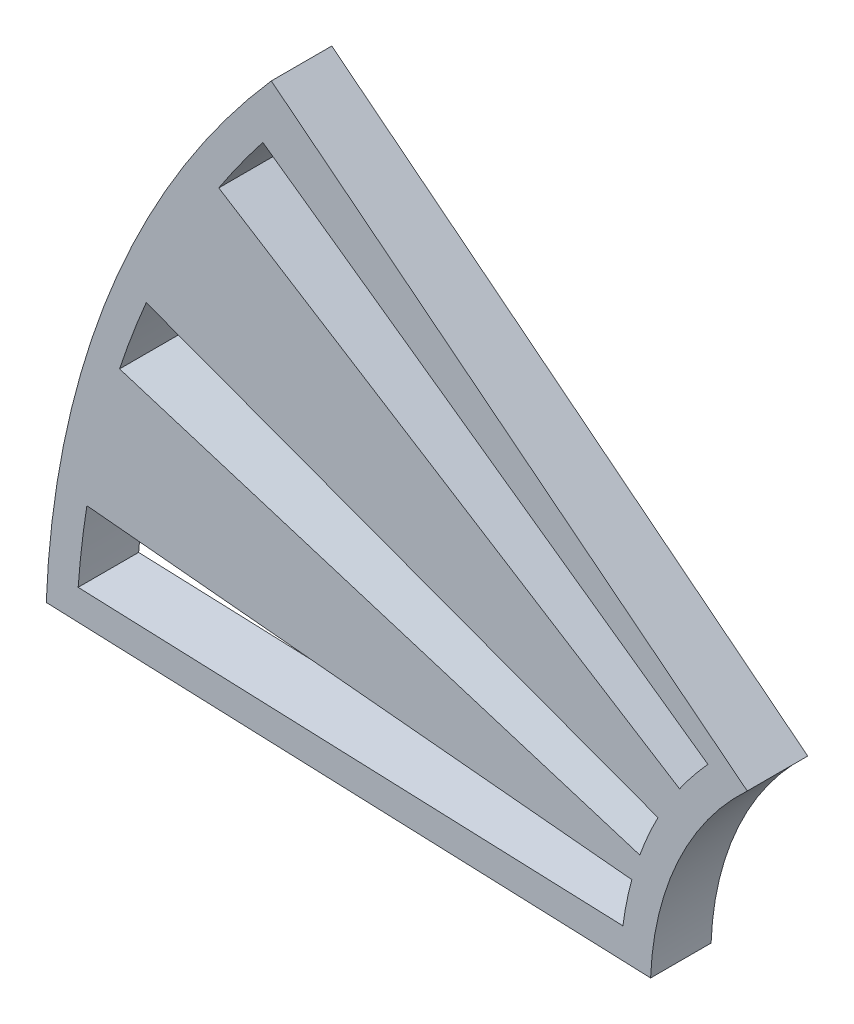
ISO-10303-21;
HEADER;
FILE_DESCRIPTION(('STEP AP214'),'2;1');
FILE_NAME('part.step','',(''),(''),'','','');
FILE_SCHEMA(('AUTOMOTIVE_DESIGN { 1 0 10303 214 1 1 1 1 }'));
ENDSEC;
DATA;
#1=APPLICATION_CONTEXT('core data for automotive mechanical design processes');
#2=APPLICATION_PROTOCOL_DEFINITION('international standard','automotive_design',2000,#1);
#3=PRODUCT_CONTEXT('',#1,'mechanical');
#4=PRODUCT('Part','Part','',(#3));
#5=PRODUCT_RELATED_PRODUCT_CATEGORY('part','',(#4));
#6=PRODUCT_DEFINITION_FORMATION('','',#4);
#7=PRODUCT_DEFINITION_CONTEXT('part definition',#1,'design');
#8=PRODUCT_DEFINITION('design','',#6,#7);
#9=PRODUCT_DEFINITION_SHAPE('','',#8);
#10=(LENGTH_UNIT() NAMED_UNIT(*) SI_UNIT(.MILLI.,.METRE.));
#11=(NAMED_UNIT(*) PLANE_ANGLE_UNIT() SI_UNIT($,.RADIAN.));
#12=(NAMED_UNIT(*) SI_UNIT($,.STERADIAN.) SOLID_ANGLE_UNIT());
#13=UNCERTAINTY_MEASURE_WITH_UNIT(LENGTH_MEASURE(1.E-05),#10,'distance_accuracy_value','');
#14=(GEOMETRIC_REPRESENTATION_CONTEXT(3) GLOBAL_UNCERTAINTY_ASSIGNED_CONTEXT((#13)) GLOBAL_UNIT_ASSIGNED_CONTEXT((#10,
#11,#12)) REPRESENTATION_CONTEXT('',''));
#15=CARTESIAN_POINT('',(0.,0.,0.));
#16=DIRECTION('',(0.,0.,1.));
#17=DIRECTION('',(1.,0.,0.));
#18=AXIS2_PLACEMENT_3D('',#15,#16,#17);
#19=CARTESIAN_POINT('',(0.,0.,4.));
#20=DIRECTION('',(0.,0.,1.));
#21=DIRECTION('',(1.,0.,0.));
#22=AXIS2_PLACEMENT_3D('',#19,#20,#21);
#23=PLANE('',#22);
#24=CARTESIAN_POINT('',(0.,0.,4.));
#25=DIRECTION('',(0.,0.,1.));
#26=DIRECTION('',(1.,0.,0.));
#27=AXIS2_PLACEMENT_3D('',#24,#25,#26);
#28=CIRCLE('',#27,22.);
#29=CARTESIAN_POINT('',(-16.3569194216375,14.7122801439497,4.));
#30=VERTEX_POINT('',#29);
#31=CARTESIAN_POINT('',(-18.0672432142084,12.5528770661805,4.));
#32=VERTEX_POINT('',#31);
#33=EDGE_CURVE('E367',#30,#32,#28,.T.);
#34=ORIENTED_EDGE('',*,*,#33,.T.);
#35=DIRECTION('',(-0.846325198964337,0.532666553857078,0.));
#36=VECTOR('',#35,1.);
#37=CARTESIAN_POINT('',(0.532666553857077,0.846325198964337,4.));
#38=LINE('',#37,#36);
#39=CARTESIAN_POINT('',(-48.5468985369015,31.7363930283167,4.));
#40=VERTEX_POINT('',#39);
#41=EDGE_CURVE('E382',#32,#40,#38,.T.);
#42=ORIENTED_EDGE('',*,*,#41,.T.);
#43=CARTESIAN_POINT('',(0.,0.,4.));
#44=DIRECTION('',(0.,0.,1.));
#45=DIRECTION('',(1.,0.,0.));
#46=AXIS2_PLACEMENT_3D('',#43,#44,#45);
#47=CIRCLE('',#46,58.);
#48=CARTESIAN_POINT('',(-45.6331540183943,35.7996543884644,4.));
#49=VERTEX_POINT('',#48);
#50=EDGE_CURVE('E358',#49,#40,#47,.T.);
#51=ORIENTED_EDGE('',*,*,#50,.F.);
#52=DIRECTION('',(-0.81535782054526,0.578957359807856,0.));
#53=VECTOR('',#52,1.);
#54=CARTESIAN_POINT('',(1.60364114285886,2.25844153291714,4.));
#55=LINE('',#54,#53);
#56=CARTESIAN_POINT('',(-16.191490090042,14.8941481348908,4.));
#57=VERTEX_POINT('',#56);
#58=EDGE_CURVE('E385',#57,#49,#55,.T.);
#59=ORIENTED_EDGE('',*,*,#58,.F.);
#60=DIRECTION('',(0.672883873931036,0.739748127543126,0.));
#61=VECTOR('',#60,1.);
#62=CARTESIAN_POINT('',(-16.2742047558396,14.8032141394205,4.));
#63=LINE('',#62,#61);
#64=EDGE_CURVE('E387',#30,#57,#63,.T.);
#65=ORIENTED_EDGE('',*,*,#64,.F.);
#66=EDGE_LOOP('',(#34,#42,#51,#59,#65));
#67=FACE_BOUND('',#66,.T.);
#68=CARTESIAN_POINT('',(0.,0.,4.));
#69=DIRECTION('',(0.,0.,1.));
#70=DIRECTION('',(1.,0.,0.));
#71=AXIS2_PLACEMENT_3D('',#68,#69,#70);
#72=CIRCLE('',#71,58.);
#73=CARTESIAN_POINT('',(-53.3438743652165,22.7690813979834,4.));
#74=VERTEX_POINT('',#73);
#75=CARTESIAN_POINT('',(-55.1066860216154,18.0901397373016,4.));
#76=VERTEX_POINT('',#75);
#77=EDGE_CURVE('E429',#74,#76,#72,.T.);
#78=ORIENTED_EDGE('',*,*,#77,.F.);
#79=DIRECTION('',(-0.93742036755198,0.348199733628144,0.));
#80=VECTOR('',#79,1.);
#81=CARTESIAN_POINT('',(0.964470715017603,2.59653987309038,4.));
#82=LINE('',#81,#80);
#83=CARTESIAN_POINT('',(-19.494667641963,10.1959763401746,4.));
#84=VERTEX_POINT('',#83);
#85=EDGE_CURVE('E426',#84,#74,#82,.T.);
#86=ORIENTED_EDGE('',*,*,#85,.F.);
#87=CARTESIAN_POINT('',(0.,0.,4.));
#88=DIRECTION('',(0.,0.,1.));
#89=DIRECTION('',(1.,0.,0.));
#90=AXIS2_PLACEMENT_3D('',#87,#88,#89);
#91=CIRCLE('',#90,22.);
#92=CARTESIAN_POINT('',(-20.700540486008,7.44900151611905,4.));
#93=VERTEX_POINT('',#92);
#94=EDGE_CURVE('E423',#84,#93,#91,.T.);
#95=ORIENTED_EDGE('',*,*,#94,.T.);
#96=DIRECTION('',(-0.955351615946227,0.295471301328797,0.));
#97=VECTOR('',#96,1.);
#98=CARTESIAN_POINT('',(0.295471301328797,0.955351615946228,4.));
#99=LINE('',#98,#97);
#100=EDGE_CURVE('E431',#93,#76,#99,.T.);
#101=ORIENTED_EDGE('',*,*,#100,.T.);
#102=EDGE_LOOP('',(#78,#86,#95,#101));
#103=FACE_BOUND('',#102,.T.);
#104=CARTESIAN_POINT('',(0.,0.,4.));
#105=DIRECTION('',(0.,0.,1.));
#106=DIRECTION('',(1.,0.,0.));
#107=AXIS2_PLACEMENT_3D('',#104,#105,#106);
#108=CIRCLE('',#107,20.);
#109=CARTESIAN_POINT('',(-13.592462365831,14.671229220262,4.));
#110=VERTEX_POINT('',#109);
#111=CARTESIAN_POINT('',(-19.9854479818915,0.762803358087425,4.));
#112=VERTEX_POINT('',#111);
#113=EDGE_CURVE('E454',#110,#112,#108,.T.);
#114=ORIENTED_EDGE('',*,*,#113,.F.);
#115=DIRECTION('',(-0.783940113940182,0.620836450086055,0.));
#116=VECTOR('',#115,1.);
#117=CARTESIAN_POINT('',(-13.592462365831,14.671229220262,4.));
#118=LINE('',#117,#116);
#119=CARTESIAN_POINT('',(-45.0736727010104,39.6025760430074,4.));
#120=VERTEX_POINT('',#119);
#121=EDGE_CURVE('E463',#110,#120,#118,.T.);
#122=ORIENTED_EDGE('',*,*,#121,.T.);
#123=CARTESIAN_POINT('',(0.,0.,4.));
#124=DIRECTION('',(0.,0.,1.));
#125=DIRECTION('',(1.,0.,0.));
#126=AXIS2_PLACEMENT_3D('',#123,#124,#125);
#127=CIRCLE('',#126,60.);
#128=CARTESIAN_POINT('',(-59.9563439456744,2.28841007426227,4.));
#129=VERTEX_POINT('',#128);
#130=EDGE_CURVE('E461',#120,#129,#127,.T.);
#131=ORIENTED_EDGE('',*,*,#130,.T.);
#132=DIRECTION('',(-0.999272399094574,0.0381401679043713,0.));
#133=VECTOR('',#132,1.);
#134=CARTESIAN_POINT('',(-19.9854479818915,0.762803358087425,4.));
#135=LINE('',#134,#133);
#136=EDGE_CURVE('E457',#112,#129,#135,.T.);
#137=ORIENTED_EDGE('',*,*,#136,.F.);
#138=EDGE_LOOP('',(#114,#122,#131,#137));
#139=FACE_BOUND('',#138,.T.);
#140=CARTESIAN_POINT('',(0.,0.,4.));
#141=DIRECTION('',(0.,0.,1.));
#142=DIRECTION('',(1.,0.,0.));
#143=AXIS2_PLACEMENT_3D('',#140,#141,#142);
#144=CIRCLE('',#143,58.);
#145=CARTESIAN_POINT('',(-57.2695634611574,9.17589782901159,4.));
#146=VERTEX_POINT('',#145);
#147=CARTESIAN_POINT('',(-57.8470508935835,4.20935896724981,4.));
#148=VERTEX_POINT('',#147);
#149=EDGE_CURVE('E420',#146,#148,#144,.T.);
#150=ORIENTED_EDGE('',*,*,#149,.F.);
#151=DIRECTION('',(-0.995579779225786,0.0939196635254627,0.));
#152=VECTOR('',#151,1.);
#153=CARTESIAN_POINT('',(0.352818627186008,3.7399952020203,4.));
#154=LINE('',#153,#152);
#155=CARTESIAN_POINT('',(-21.228263800293,5.77588227244706,4.));
#156=VERTEX_POINT('',#155);
#157=EDGE_CURVE('E405',#156,#146,#154,.T.);
#158=ORIENTED_EDGE('',*,*,#157,.F.);
#159=CARTESIAN_POINT('',(0.,0.,4.));
#160=DIRECTION('',(0.,0.,1.));
#161=DIRECTION('',(1.,0.,0.));
#162=AXIS2_PLACEMENT_3D('',#159,#160,#161);
#163=CIRCLE('',#162,22.);
#164=CARTESIAN_POINT('',(-21.8166810272474,2.8341540105195,4.));
#165=VERTEX_POINT('',#164);
#166=EDGE_CURVE('E400',#156,#165,#163,.T.);
#167=ORIENTED_EDGE('',*,*,#166,.T.);
#168=DIRECTION('',(-0.999272399094574,0.0381401679043713,0.));
#169=VECTOR('',#168,1.);
#170=CARTESIAN_POINT('',(0.0762803358087425,1.99854479818915,4.));
#171=LINE('',#170,#169);
#172=EDGE_CURVE('E417',#165,#148,#171,.T.);
#173=ORIENTED_EDGE('',*,*,#172,.T.);
#174=EDGE_LOOP('',(#150,#158,#167,#173));
#175=FACE_BOUND('',#174,.T.);
#176=ADVANCED_FACE('F232',(#67,#103,#139,#175),#23,.T.);
#177=CARTESIAN_POINT('',(0.,0.,0.));
#178=DIRECTION('',(0.,0.,1.));
#179=DIRECTION('',(1.,0.,0.));
#180=AXIS2_PLACEMENT_3D('',#177,#178,#179);
#181=PLANE('',#180);
#182=DIRECTION('',(-0.846325198964337,0.532666553857078,0.));
#183=VECTOR('',#182,1.);
#184=CARTESIAN_POINT('',(0.532666553857077,0.846325198964337,0.));
#185=LINE('',#184,#183);
#186=CARTESIAN_POINT('',(-18.0672432142084,12.5528770661805,0.));
#187=VERTEX_POINT('',#186);
#188=CARTESIAN_POINT('',(-48.5468985369015,31.7363930283167,0.));
#189=VERTEX_POINT('',#188);
#190=EDGE_CURVE('E364',#187,#189,#185,.T.);
#191=ORIENTED_EDGE('',*,*,#190,.F.);
#192=CARTESIAN_POINT('',(0.,0.,0.));
#193=DIRECTION('',(0.,0.,1.));
#194=DIRECTION('',(1.,0.,0.));
#195=AXIS2_PLACEMENT_3D('',#192,#193,#194);
#196=CIRCLE('',#195,22.);
#197=CARTESIAN_POINT('',(-16.3569194216375,14.7122801439497,0.));
#198=VERTEX_POINT('',#197);
#199=EDGE_CURVE('E257',#198,#187,#196,.T.);
#200=ORIENTED_EDGE('',*,*,#199,.F.);
#201=DIRECTION('',(0.672883873931036,0.739748127543126,0.));
#202=VECTOR('',#201,1.);
#203=CARTESIAN_POINT('',(-16.2742047558396,14.8032141394205,0.));
#204=LINE('',#203,#202);
#205=CARTESIAN_POINT('',(-16.191490090042,14.8941481348908,0.));
#206=VERTEX_POINT('',#205);
#207=EDGE_CURVE('E375',#198,#206,#204,.T.);
#208=ORIENTED_EDGE('',*,*,#207,.T.);
#209=DIRECTION('',(-0.81535782054526,0.578957359807856,0.));
#210=VECTOR('',#209,1.);
#211=CARTESIAN_POINT('',(1.60364114285886,2.25844153291714,0.));
#212=LINE('',#211,#210);
#213=CARTESIAN_POINT('',(-45.6331540183943,35.7996543884644,0.));
#214=VERTEX_POINT('',#213);
#215=EDGE_CURVE('E373',#206,#214,#212,.T.);
#216=ORIENTED_EDGE('',*,*,#215,.T.);
#217=CARTESIAN_POINT('',(0.,0.,0.));
#218=DIRECTION('',(0.,0.,1.));
#219=DIRECTION('',(1.,0.,0.));
#220=AXIS2_PLACEMENT_3D('',#217,#218,#219);
#221=CIRCLE('',#220,58.);
#222=EDGE_CURVE('E355',#214,#189,#221,.T.);
#223=ORIENTED_EDGE('',*,*,#222,.T.);
#224=EDGE_LOOP('',(#191,#200,#208,#216,#223));
#225=FACE_BOUND('',#224,.T.);
#226=DIRECTION('',(-0.93742036755198,0.348199733628144,0.));
#227=VECTOR('',#226,1.);
#228=CARTESIAN_POINT('',(0.964470715017603,2.59653987309038,0.));
#229=LINE('',#228,#227);
#230=CARTESIAN_POINT('',(-19.494667641963,10.1959763401746,0.));
#231=VERTEX_POINT('',#230);
#232=CARTESIAN_POINT('',(-53.3438743652165,22.7690813979834,0.));
#233=VERTEX_POINT('',#232);
#234=EDGE_CURVE('E437',#231,#233,#229,.T.);
#235=ORIENTED_EDGE('',*,*,#234,.T.);
#236=CARTESIAN_POINT('',(0.,0.,0.));
#237=DIRECTION('',(0.,0.,1.));
#238=DIRECTION('',(1.,0.,0.));
#239=AXIS2_PLACEMENT_3D('',#236,#237,#238);
#240=CIRCLE('',#239,58.);
#241=CARTESIAN_POINT('',(-55.1066860216154,18.0901397373016,0.));
#242=VERTEX_POINT('',#241);
#243=EDGE_CURVE('E440',#233,#242,#240,.T.);
#244=ORIENTED_EDGE('',*,*,#243,.T.);
#245=DIRECTION('',(-0.955351615946227,0.295471301328797,0.));
#246=VECTOR('',#245,1.);
#247=CARTESIAN_POINT('',(0.295471301328797,0.955351615946228,0.));
#248=LINE('',#247,#246);
#249=CARTESIAN_POINT('',(-20.700540486008,7.44900151611905,0.));
#250=VERTEX_POINT('',#249);
#251=EDGE_CURVE('E427',#250,#242,#248,.T.);
#252=ORIENTED_EDGE('',*,*,#251,.F.);
#253=CARTESIAN_POINT('',(0.,0.,0.));
#254=DIRECTION('',(0.,0.,1.));
#255=DIRECTION('',(1.,0.,0.));
#256=AXIS2_PLACEMENT_3D('',#253,#254,#255);
#257=CIRCLE('',#256,22.);
#258=EDGE_CURVE('E414',#231,#250,#257,.T.);
#259=ORIENTED_EDGE('',*,*,#258,.F.);
#260=EDGE_LOOP('',(#235,#244,#252,#259));
#261=FACE_BOUND('',#260,.T.);
#262=CARTESIAN_POINT('',(0.,0.,0.));
#263=DIRECTION('',(0.,0.,1.));
#264=DIRECTION('',(1.,0.,0.));
#265=AXIS2_PLACEMENT_3D('',#262,#263,#264);
#266=CIRCLE('',#265,20.);
#267=CARTESIAN_POINT('',(-13.592462365831,14.671229220262,0.));
#268=VERTEX_POINT('',#267);
#269=CARTESIAN_POINT('',(-19.9854479818915,0.762803358087425,0.));
#270=VERTEX_POINT('',#269);
#271=EDGE_CURVE('E453',#268,#270,#266,.T.);
#272=ORIENTED_EDGE('',*,*,#271,.T.);
#273=DIRECTION('',(-0.999272399094574,0.0381401679043713,0.));
#274=VECTOR('',#273,1.);
#275=CARTESIAN_POINT('',(-19.9854479818915,0.762803358087425,0.));
#276=LINE('',#275,#274);
#277=CARTESIAN_POINT('',(-59.9563439456744,2.28841007426227,0.));
#278=VERTEX_POINT('',#277);
#279=EDGE_CURVE('E467',#270,#278,#276,.T.);
#280=ORIENTED_EDGE('',*,*,#279,.T.);
#281=CARTESIAN_POINT('',(0.,0.,0.));
#282=DIRECTION('',(0.,0.,1.));
#283=DIRECTION('',(1.,0.,0.));
#284=AXIS2_PLACEMENT_3D('',#281,#282,#283);
#285=CIRCLE('',#284,60.);
#286=CARTESIAN_POINT('',(-45.0736727010104,39.6025760430074,0.));
#287=VERTEX_POINT('',#286);
#288=EDGE_CURVE('E470',#287,#278,#285,.T.);
#289=ORIENTED_EDGE('',*,*,#288,.F.);
#290=DIRECTION('',(-0.783940113940182,0.620836450086055,0.));
#291=VECTOR('',#290,1.);
#292=CARTESIAN_POINT('',(-13.592462365831,14.671229220262,0.));
#293=LINE('',#292,#291);
#294=EDGE_CURVE('E458',#268,#287,#293,.T.);
#295=ORIENTED_EDGE('',*,*,#294,.F.);
#296=EDGE_LOOP('',(#272,#280,#289,#295));
#297=FACE_BOUND('',#296,.T.);
#298=DIRECTION('',(-0.995579779225786,0.0939196635254627,0.));
#299=VECTOR('',#298,1.);
#300=CARTESIAN_POINT('',(0.352818627186008,3.7399952020203,0.));
#301=LINE('',#300,#299);
#302=CARTESIAN_POINT('',(-21.228263800293,5.77588227244706,0.));
#303=VERTEX_POINT('',#302);
#304=CARTESIAN_POINT('',(-57.2695634611574,9.17589782901159,0.));
#305=VERTEX_POINT('',#304);
#306=EDGE_CURVE('E411',#303,#305,#301,.T.);
#307=ORIENTED_EDGE('',*,*,#306,.T.);
#308=CARTESIAN_POINT('',(0.,0.,0.));
#309=DIRECTION('',(0.,0.,1.));
#310=DIRECTION('',(1.,0.,0.));
#311=AXIS2_PLACEMENT_3D('',#308,#309,#310);
#312=CIRCLE('',#311,58.);
#313=CARTESIAN_POINT('',(-57.8470508935835,4.20935896724981,0.));
#314=VERTEX_POINT('',#313);
#315=EDGE_CURVE('E408',#305,#314,#312,.T.);
#316=ORIENTED_EDGE('',*,*,#315,.T.);
#317=DIRECTION('',(-0.999272399094574,0.0381401679043713,0.));
#318=VECTOR('',#317,1.);
#319=CARTESIAN_POINT('',(0.0762803358087425,1.99854479818915,0.));
#320=LINE('',#319,#318);
#321=CARTESIAN_POINT('',(-21.8166810272474,2.8341540105195,0.));
#322=VERTEX_POINT('',#321);
#323=EDGE_CURVE('E404',#322,#314,#320,.T.);
#324=ORIENTED_EDGE('',*,*,#323,.F.);
#325=CARTESIAN_POINT('',(0.,0.,0.));
#326=DIRECTION('',(0.,0.,1.));
#327=DIRECTION('',(1.,0.,0.));
#328=AXIS2_PLACEMENT_3D('',#325,#326,#327);
#329=CIRCLE('',#328,22.);
#330=EDGE_CURVE('E401',#303,#322,#329,.T.);
#331=ORIENTED_EDGE('',*,*,#330,.F.);
#332=EDGE_LOOP('',(#307,#316,#324,#331));
#333=FACE_BOUND('',#332,.T.);
#334=ADVANCED_FACE('F369',(#225,#261,#297,#333),#181,.F.);
#335=CARTESIAN_POINT('',(0.,0.,4.));
#336=DIRECTION('',(0.,0.,-1.));
#337=DIRECTION('',(-1.,0.,0.));
#338=AXIS2_PLACEMENT_3D('',#335,#336,#337);
#339=CYLINDRICAL_SURFACE('',#338,20.);
#340=ORIENTED_EDGE('',*,*,#271,.F.);
#341=DIRECTION('',(0.,0.,-1.));
#342=VECTOR('',#341,1.);
#343=CARTESIAN_POINT('',(-13.592462365831,14.671229220262,4.));
#344=LINE('',#343,#342);
#345=EDGE_CURVE('E12',#110,#268,#344,.T.);
#346=ORIENTED_EDGE('',*,*,#345,.F.);
#347=ORIENTED_EDGE('',*,*,#113,.T.);
#348=DIRECTION('',(0.,0.,-1.));
#349=VECTOR('',#348,1.);
#350=CARTESIAN_POINT('',(-19.9854479818915,0.762803358087425,4.));
#351=LINE('',#350,#349);
#352=EDGE_CURVE('E236',#112,#270,#351,.T.);
#353=ORIENTED_EDGE('',*,*,#352,.T.);
#354=EDGE_LOOP('',(#340,#346,#347,#353));
#355=FACE_BOUND('',#354,.T.);
#356=ADVANCED_FACE('F234',(#355),#339,.F.);
#357=CARTESIAN_POINT('',(-13.592462365831,14.671229220262,4.));
#358=DIRECTION('',(-0.620836450086055,-0.783940113940182,0.));
#359=DIRECTION('',(0.783940113940182,-0.620836450086055,0.));
#360=AXIS2_PLACEMENT_3D('',#357,#358,#359);
#361=PLANE('',#360);
#362=ORIENTED_EDGE('',*,*,#294,.T.);
#363=DIRECTION('',(0.,0.,-1.));
#364=VECTOR('',#363,1.);
#365=CARTESIAN_POINT('',(-45.0736727010104,39.6025760430074,4.));
#366=LINE('',#365,#364);
#367=EDGE_CURVE('E241',#120,#287,#366,.T.);
#368=ORIENTED_EDGE('',*,*,#367,.F.);
#369=ORIENTED_EDGE('',*,*,#121,.F.);
#370=ORIENTED_EDGE('',*,*,#345,.T.);
#371=EDGE_LOOP('',(#362,#368,#369,#370));
#372=FACE_BOUND('',#371,.T.);
#373=ADVANCED_FACE('F490',(#372),#361,.F.);
#374=CARTESIAN_POINT('',(0.,0.,4.));
#375=DIRECTION('',(0.,0.,-1.));
#376=DIRECTION('',(-1.,0.,0.));
#377=AXIS2_PLACEMENT_3D('',#374,#375,#376);
#378=CYLINDRICAL_SURFACE('',#377,60.);
#379=ORIENTED_EDGE('',*,*,#288,.T.);
#380=DIRECTION('',(0.,0.,-1.));
#381=VECTOR('',#380,1.);
#382=CARTESIAN_POINT('',(-59.9563439456744,2.28841007426227,4.));
#383=LINE('',#382,#381);
#384=EDGE_CURVE('E475',#129,#278,#383,.T.);
#385=ORIENTED_EDGE('',*,*,#384,.F.);
#386=ORIENTED_EDGE('',*,*,#130,.F.);
#387=ORIENTED_EDGE('',*,*,#367,.T.);
#388=EDGE_LOOP('',(#379,#385,#386,#387));
#389=FACE_BOUND('',#388,.T.);
#390=ADVANCED_FACE('F494',(#389),#378,.T.);
#391=CARTESIAN_POINT('',(-19.9854479818915,0.762803358087425,4.));
#392=DIRECTION('',(-0.0381401679043713,-0.999272399094575,0.));
#393=DIRECTION('',(0.999272399094575,-0.0381401679043713,0.));
#394=AXIS2_PLACEMENT_3D('',#391,#392,#393);
#395=PLANE('',#394);
#396=ORIENTED_EDGE('',*,*,#279,.F.);
#397=ORIENTED_EDGE('',*,*,#352,.F.);
#398=ORIENTED_EDGE('',*,*,#136,.T.);
#399=ORIENTED_EDGE('',*,*,#384,.T.);
#400=EDGE_LOOP('',(#396,#397,#398,#399));
#401=FACE_BOUND('',#400,.T.);
#402=ADVANCED_FACE('F483',(#401),#395,.T.);
#403=CARTESIAN_POINT('',(0.964470715017603,2.59653987309038,4.));
#404=DIRECTION('',(-0.348199733628144,-0.93742036755198,0.));
#405=DIRECTION('',(0.93742036755198,-0.348199733628144,0.));
#406=AXIS2_PLACEMENT_3D('',#403,#404,#405);
#407=PLANE('',#406);
#408=ORIENTED_EDGE('',*,*,#234,.F.);
#409=DIRECTION('',(0.,0.,-1.));
#410=VECTOR('',#409,1.);
#411=CARTESIAN_POINT('',(-19.494667641963,10.1959763401746,4.));
#412=LINE('',#411,#410);
#413=EDGE_CURVE('E450',#84,#231,#412,.T.);
#414=ORIENTED_EDGE('',*,*,#413,.F.);
#415=ORIENTED_EDGE('',*,*,#85,.T.);
#416=DIRECTION('',(0.,0.,-1.));
#417=VECTOR('',#416,1.);
#418=CARTESIAN_POINT('',(-53.3438743652165,22.7690813979834,4.));
#419=LINE('',#418,#417);
#420=EDGE_CURVE('E448',#74,#233,#419,.T.);
#421=ORIENTED_EDGE('',*,*,#420,.T.);
#422=EDGE_LOOP('',(#408,#414,#415,#421));
#423=FACE_BOUND('',#422,.T.);
#424=ADVANCED_FACE('F536',(#423),#407,.T.);
#425=CARTESIAN_POINT('',(0.,0.,4.));
#426=DIRECTION('',(0.,0.,-1.));
#427=DIRECTION('',(-1.,0.,0.));
#428=AXIS2_PLACEMENT_3D('',#425,#426,#427);
#429=CYLINDRICAL_SURFACE('',#428,58.);
#430=ORIENTED_EDGE('',*,*,#243,.F.);
#431=ORIENTED_EDGE('',*,*,#420,.F.);
#432=ORIENTED_EDGE('',*,*,#77,.T.);
#433=DIRECTION('',(0.,0.,-1.));
#434=VECTOR('',#433,1.);
#435=CARTESIAN_POINT('',(-55.1066860216154,18.0901397373016,4.));
#436=LINE('',#435,#434);
#437=EDGE_CURVE('E446',#76,#242,#436,.T.);
#438=ORIENTED_EDGE('',*,*,#437,.T.);
#439=EDGE_LOOP('',(#430,#431,#432,#438));
#440=FACE_BOUND('',#439,.T.);
#441=ADVANCED_FACE('F532',(#440),#429,.F.);
#442=CARTESIAN_POINT('',(0.295471301328797,0.955351615946228,4.));
#443=DIRECTION('',(-0.295471301328797,-0.955351615946227,0.));
#444=DIRECTION('',(0.955351615946227,-0.295471301328797,0.));
#445=AXIS2_PLACEMENT_3D('',#442,#443,#444);
#446=PLANE('',#445);
#447=ORIENTED_EDGE('',*,*,#251,.T.);
#448=ORIENTED_EDGE('',*,*,#437,.F.);
#449=ORIENTED_EDGE('',*,*,#100,.F.);
#450=DIRECTION('',(0.,0.,-1.));
#451=VECTOR('',#450,1.);
#452=CARTESIAN_POINT('',(-20.700540486008,7.44900151611905,4.));
#453=LINE('',#452,#451);
#454=EDGE_CURVE('E434',#93,#250,#453,.T.);
#455=ORIENTED_EDGE('',*,*,#454,.T.);
#456=EDGE_LOOP('',(#447,#448,#449,#455));
#457=FACE_BOUND('',#456,.T.);
#458=ADVANCED_FACE('F528',(#457),#446,.F.);
#459=CARTESIAN_POINT('',(0.,0.,4.));
#460=DIRECTION('',(0.,0.,-1.));
#461=DIRECTION('',(-1.,0.,0.));
#462=AXIS2_PLACEMENT_3D('',#459,#460,#461);
#463=CYLINDRICAL_SURFACE('',#462,22.);
#464=ORIENTED_EDGE('',*,*,#258,.T.);
#465=ORIENTED_EDGE('',*,*,#454,.F.);
#466=ORIENTED_EDGE('',*,*,#94,.F.);
#467=ORIENTED_EDGE('',*,*,#413,.T.);
#468=EDGE_LOOP('',(#464,#465,#466,#467));
#469=FACE_BOUND('',#468,.T.);
#470=ADVANCED_FACE('F531',(#469),#463,.T.);
#471=CARTESIAN_POINT('',(0.352818627186008,3.7399952020203,4.));
#472=DIRECTION('',(-0.0939196635254627,-0.995579779225786,0.));
#473=DIRECTION('',(0.995579779225786,-0.0939196635254627,0.));
#474=AXIS2_PLACEMENT_3D('',#471,#472,#473);
#475=PLANE('',#474);
#476=ORIENTED_EDGE('',*,*,#306,.F.);
#477=DIRECTION('',(0.,0.,-1.));
#478=VECTOR('',#477,1.);
#479=CARTESIAN_POINT('',(-21.228263800293,5.77588227244706,4.));
#480=LINE('',#479,#478);
#481=EDGE_CURVE('E397',#156,#303,#480,.T.);
#482=ORIENTED_EDGE('',*,*,#481,.F.);
#483=ORIENTED_EDGE('',*,*,#157,.T.);
#484=DIRECTION('',(0.,0.,-1.));
#485=VECTOR('',#484,1.);
#486=CARTESIAN_POINT('',(-57.2695634611574,9.17589782901159,4.));
#487=LINE('',#486,#485);
#488=EDGE_CURVE('E381',#146,#305,#487,.T.);
#489=ORIENTED_EDGE('',*,*,#488,.T.);
#490=EDGE_LOOP('',(#476,#482,#483,#489));
#491=FACE_BOUND('',#490,.T.);
#492=ADVANCED_FACE('F512',(#491),#475,.T.);
#493=CARTESIAN_POINT('',(0.,0.,4.));
#494=DIRECTION('',(0.,0.,-1.));
#495=DIRECTION('',(-1.,0.,0.));
#496=AXIS2_PLACEMENT_3D('',#493,#494,#495);
#497=CYLINDRICAL_SURFACE('',#496,58.);
#498=ORIENTED_EDGE('',*,*,#315,.F.);
#499=ORIENTED_EDGE('',*,*,#488,.F.);
#500=ORIENTED_EDGE('',*,*,#149,.T.);
#501=DIRECTION('',(0.,0.,-1.));
#502=VECTOR('',#501,1.);
#503=CARTESIAN_POINT('',(-57.8470508935835,4.20935896724981,4.));
#504=LINE('',#503,#502);
#505=EDGE_CURVE('E393',#148,#314,#504,.T.);
#506=ORIENTED_EDGE('',*,*,#505,.T.);
#507=EDGE_LOOP('',(#498,#499,#500,#506));
#508=FACE_BOUND('',#507,.T.);
#509=ADVANCED_FACE('F505',(#508),#497,.F.);
#510=CARTESIAN_POINT('',(0.0762803358087425,1.99854479818915,4.));
#511=DIRECTION('',(-0.0381401679043713,-0.999272399094575,0.));
#512=DIRECTION('',(0.999272399094575,-0.0381401679043713,0.));
#513=AXIS2_PLACEMENT_3D('',#510,#511,#512);
#514=PLANE('',#513);
#515=ORIENTED_EDGE('',*,*,#323,.T.);
#516=ORIENTED_EDGE('',*,*,#505,.F.);
#517=ORIENTED_EDGE('',*,*,#172,.F.);
#518=DIRECTION('',(0.,0.,-1.));
#519=VECTOR('',#518,1.);
#520=CARTESIAN_POINT('',(-21.8166810272474,2.8341540105195,4.));
#521=LINE('',#520,#519);
#522=EDGE_CURVE('E395',#165,#322,#521,.T.);
#523=ORIENTED_EDGE('',*,*,#522,.T.);
#524=EDGE_LOOP('',(#515,#516,#517,#523));
#525=FACE_BOUND('',#524,.T.);
#526=ADVANCED_FACE('F507',(#525),#514,.F.);
#527=CARTESIAN_POINT('',(0.,0.,4.));
#528=DIRECTION('',(0.,0.,-1.));
#529=DIRECTION('',(-1.,0.,0.));
#530=AXIS2_PLACEMENT_3D('',#527,#528,#529);
#531=CYLINDRICAL_SURFACE('',#530,22.);
#532=ORIENTED_EDGE('',*,*,#330,.T.);
#533=ORIENTED_EDGE('',*,*,#522,.F.);
#534=ORIENTED_EDGE('',*,*,#166,.F.);
#535=ORIENTED_EDGE('',*,*,#481,.T.);
#536=EDGE_LOOP('',(#532,#533,#534,#535));
#537=FACE_BOUND('',#536,.T.);
#538=ADVANCED_FACE('F515',(#537),#531,.T.);
#539=CARTESIAN_POINT('',(0.,0.,4.));
#540=DIRECTION('',(0.,0.,-1.));
#541=DIRECTION('',(-1.,0.,0.));
#542=AXIS2_PLACEMENT_3D('',#539,#540,#541);
#543=CYLINDRICAL_SURFACE('',#542,22.);
#544=ORIENTED_EDGE('',*,*,#199,.T.);
#545=DIRECTION('',(0.,0.,-1.));
#546=VECTOR('',#545,1.);
#547=CARTESIAN_POINT('',(-18.0672432142084,12.5528770661805,4.));
#548=LINE('',#547,#546);
#549=EDGE_CURVE('E360',#32,#187,#548,.T.);
#550=ORIENTED_EDGE('',*,*,#549,.F.);
#551=ORIENTED_EDGE('',*,*,#33,.F.);
#552=DIRECTION('',(0.,0.,-1.));
#553=VECTOR('',#552,1.);
#554=CARTESIAN_POINT('',(-16.3569194216375,14.7122801439497,4.));
#555=LINE('',#554,#553);
#556=EDGE_CURVE('E642',#30,#198,#555,.T.);
#557=ORIENTED_EDGE('',*,*,#556,.T.);
#558=EDGE_LOOP('',(#544,#550,#551,#557));
#559=FACE_BOUND('',#558,.T.);
#560=ADVANCED_FACE('F517',(#559),#543,.T.);
#561=CARTESIAN_POINT('',(-16.2742047558396,14.8032141394205,4.));
#562=DIRECTION('',(-0.739748127543126,0.672883873931036,0.));
#563=DIRECTION('',(-0.672883873931036,-0.739748127543126,0.));
#564=AXIS2_PLACEMENT_3D('',#561,#562,#563);
#565=PLANE('',#564);
#566=ORIENTED_EDGE('',*,*,#207,.F.);
#567=ORIENTED_EDGE('',*,*,#556,.F.);
#568=ORIENTED_EDGE('',*,*,#64,.T.);
#569=DIRECTION('',(0.,0.,-1.));
#570=VECTOR('',#569,1.);
#571=CARTESIAN_POINT('',(-16.191490090042,14.8941481348908,4.));
#572=LINE('',#571,#570);
#573=EDGE_CURVE('E639',#57,#206,#572,.T.);
#574=ORIENTED_EDGE('',*,*,#573,.T.);
#575=EDGE_LOOP('',(#566,#567,#568,#574));
#576=FACE_BOUND('',#575,.T.);
#577=ADVANCED_FACE('F523',(#576),#565,.T.);
#578=CARTESIAN_POINT('',(1.60364114285886,2.25844153291714,4.));
#579=DIRECTION('',(-0.578957359807856,-0.81535782054526,0.));
#580=DIRECTION('',(0.81535782054526,-0.578957359807856,0.));
#581=AXIS2_PLACEMENT_3D('',#578,#579,#580);
#582=PLANE('',#581);
#583=ORIENTED_EDGE('',*,*,#215,.F.);
#584=ORIENTED_EDGE('',*,*,#573,.F.);
#585=ORIENTED_EDGE('',*,*,#58,.T.);
#586=DIRECTION('',(0.,0.,-1.));
#587=VECTOR('',#586,1.);
#588=CARTESIAN_POINT('',(-45.6331540183943,35.7996543884644,4.));
#589=LINE('',#588,#587);
#590=EDGE_CURVE('E361',#49,#214,#589,.T.);
#591=ORIENTED_EDGE('',*,*,#590,.T.);
#592=EDGE_LOOP('',(#583,#584,#585,#591));
#593=FACE_BOUND('',#592,.T.);
#594=ADVANCED_FACE('F608',(#593),#582,.T.);
#595=CARTESIAN_POINT('',(0.,0.,4.));
#596=DIRECTION('',(0.,0.,-1.));
#597=DIRECTION('',(-1.,0.,0.));
#598=AXIS2_PLACEMENT_3D('',#595,#596,#597);
#599=CYLINDRICAL_SURFACE('',#598,58.);
#600=ORIENTED_EDGE('',*,*,#222,.F.);
#601=ORIENTED_EDGE('',*,*,#590,.F.);
#602=ORIENTED_EDGE('',*,*,#50,.T.);
#603=DIRECTION('',(0.,0.,-1.));
#604=VECTOR('',#603,1.);
#605=CARTESIAN_POINT('',(-48.5468985369015,31.7363930283167,4.));
#606=LINE('',#605,#604);
#607=EDGE_CURVE('E249',#40,#189,#606,.T.);
#608=ORIENTED_EDGE('',*,*,#607,.T.);
#609=EDGE_LOOP('',(#600,#601,#602,#608));
#610=FACE_BOUND('',#609,.T.);
#611=ADVANCED_FACE('F352',(#610),#599,.F.);
#612=CARTESIAN_POINT('',(0.532666553857077,0.846325198964337,4.));
#613=DIRECTION('',(-0.532666553857078,-0.846325198964337,0.));
#614=DIRECTION('',(0.846325198964337,-0.532666553857078,0.));
#615=AXIS2_PLACEMENT_3D('',#612,#613,#614);
#616=PLANE('',#615);
#617=ORIENTED_EDGE('',*,*,#190,.T.);
#618=ORIENTED_EDGE('',*,*,#607,.F.);
#619=ORIENTED_EDGE('',*,*,#41,.F.);
#620=ORIENTED_EDGE('',*,*,#549,.T.);
#621=EDGE_LOOP('',(#617,#618,#619,#620));
#622=FACE_BOUND('',#621,.T.);
#623=ADVANCED_FACE('F365',(#622),#616,.F.);
#624=CLOSED_SHELL('',(#176,#334,#356,#373,#390,#402,#424,#441,#458,#470,#492,#509,#526,#538,
#560,#577,#594,#611,#623));
#625=MANIFOLD_SOLID_BREP('B2',#624);
#626=ADVANCED_BREP_SHAPE_REPRESENTATION('',(#18,#625),#14);
#627=SHAPE_DEFINITION_REPRESENTATION(#9,#626);
ENDSEC;
END-ISO-10303-21;
